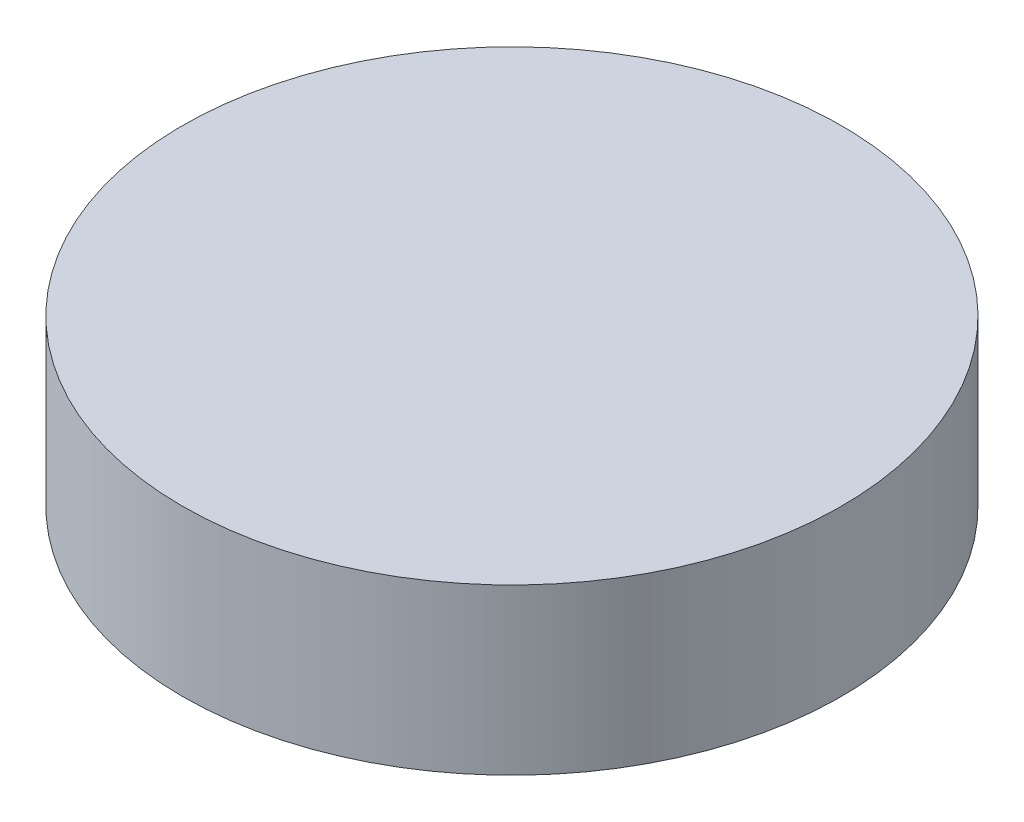
ISO-10303-21;
HEADER;
FILE_DESCRIPTION(('STEP AP214'),'2;1');
FILE_NAME('part.step','',(''),(''),'','','');
FILE_SCHEMA(('AUTOMOTIVE_DESIGN { 1 0 10303 214 1 1 1 1 }'));
ENDSEC;
DATA;
#1=APPLICATION_CONTEXT('core data for automotive mechanical design processes');
#2=APPLICATION_PROTOCOL_DEFINITION('international standard','automotive_design',2000,#1);
#3=PRODUCT_CONTEXT('',#1,'mechanical');
#4=PRODUCT('Part','Part','',(#3));
#5=PRODUCT_RELATED_PRODUCT_CATEGORY('part','',(#4));
#6=PRODUCT_DEFINITION_FORMATION('','',#4);
#7=PRODUCT_DEFINITION_CONTEXT('part definition',#1,'design');
#8=PRODUCT_DEFINITION('design','',#6,#7);
#9=PRODUCT_DEFINITION_SHAPE('','',#8);
#10=(LENGTH_UNIT() NAMED_UNIT(*) SI_UNIT(.MILLI.,.METRE.));
#11=(NAMED_UNIT(*) PLANE_ANGLE_UNIT() SI_UNIT($,.RADIAN.));
#12=(NAMED_UNIT(*) SI_UNIT($,.STERADIAN.) SOLID_ANGLE_UNIT());
#13=UNCERTAINTY_MEASURE_WITH_UNIT(LENGTH_MEASURE(1.E-05),#10,'distance_accuracy_value','');
#14=(GEOMETRIC_REPRESENTATION_CONTEXT(3) GLOBAL_UNCERTAINTY_ASSIGNED_CONTEXT((#13)) GLOBAL_UNIT_ASSIGNED_CONTEXT((#10,
#11,#12)) REPRESENTATION_CONTEXT('',''));
#15=CARTESIAN_POINT('',(0.,0.,0.));
#16=DIRECTION('',(0.,0.,1.));
#17=DIRECTION('',(1.,0.,0.));
#18=AXIS2_PLACEMENT_3D('',#15,#16,#17);
#19=CARTESIAN_POINT('',(0.,100.,0.));
#20=DIRECTION('',(0.,-1.,0.));
#21=DIRECTION('',(0.,0.,-1.));
#22=AXIS2_PLACEMENT_3D('',#19,#20,#21);
#23=CYLINDRICAL_SURFACE('',#22,200.);
#24=CARTESIAN_POINT('',(0.,100.,0.));
#25=DIRECTION('',(0.,1.,0.));
#26=DIRECTION('',(0.,0.,1.));
#27=AXIS2_PLACEMENT_3D('',#24,#25,#26);
#28=CIRCLE('',#27,200.);
#29=CARTESIAN_POINT('',(0.,100.,200.));
#30=VERTEX_POINT('',#29);
#31=EDGE_CURVE('E10',#30,#30,#28,.T.);
#32=ORIENTED_EDGE('',*,*,#31,.F.);
#33=EDGE_LOOP('',(#32));
#34=FACE_BOUND('',#33,.T.);
#35=CARTESIAN_POINT('',(0.,0.,0.));
#36=DIRECTION('',(0.,1.,0.));
#37=DIRECTION('',(0.,0.,1.));
#38=AXIS2_PLACEMENT_3D('',#35,#36,#37);
#39=CIRCLE('',#38,200.);
#40=CARTESIAN_POINT('',(0.,0.,200.));
#41=VERTEX_POINT('',#40);
#42=EDGE_CURVE('E34',#41,#41,#39,.T.);
#43=ORIENTED_EDGE('',*,*,#42,.T.);
#44=EDGE_LOOP('',(#43));
#45=FACE_BOUND('',#44,.T.);
#46=ADVANCED_FACE('F31',(#34,#45),#23,.T.);
#47=CARTESIAN_POINT('',(0.,100.,0.));
#48=DIRECTION('',(0.,1.,0.));
#49=DIRECTION('',(0.,0.,1.));
#50=AXIS2_PLACEMENT_3D('',#47,#48,#49);
#51=PLANE('',#50);
#52=ORIENTED_EDGE('',*,*,#31,.T.);
#53=EDGE_LOOP('',(#52));
#54=FACE_BOUND('',#53,.T.);
#55=ADVANCED_FACE('F46',(#54),#51,.T.);
#56=CARTESIAN_POINT('',(0.,0.,0.));
#57=DIRECTION('',(0.,1.,0.));
#58=DIRECTION('',(0.,0.,1.));
#59=AXIS2_PLACEMENT_3D('',#56,#57,#58);
#60=PLANE('',#59);
#61=ORIENTED_EDGE('',*,*,#42,.F.);
#62=EDGE_LOOP('',(#61));
#63=FACE_BOUND('',#62,.T.);
#64=ADVANCED_FACE('F44',(#63),#60,.F.);
#65=CLOSED_SHELL('',(#46,#55,#64));
#66=MANIFOLD_SOLID_BREP('B2',#65);
#67=ADVANCED_BREP_SHAPE_REPRESENTATION('',(#18,#66),#14);
#68=SHAPE_DEFINITION_REPRESENTATION(#9,#67);
ENDSEC;
END-ISO-10303-21;
